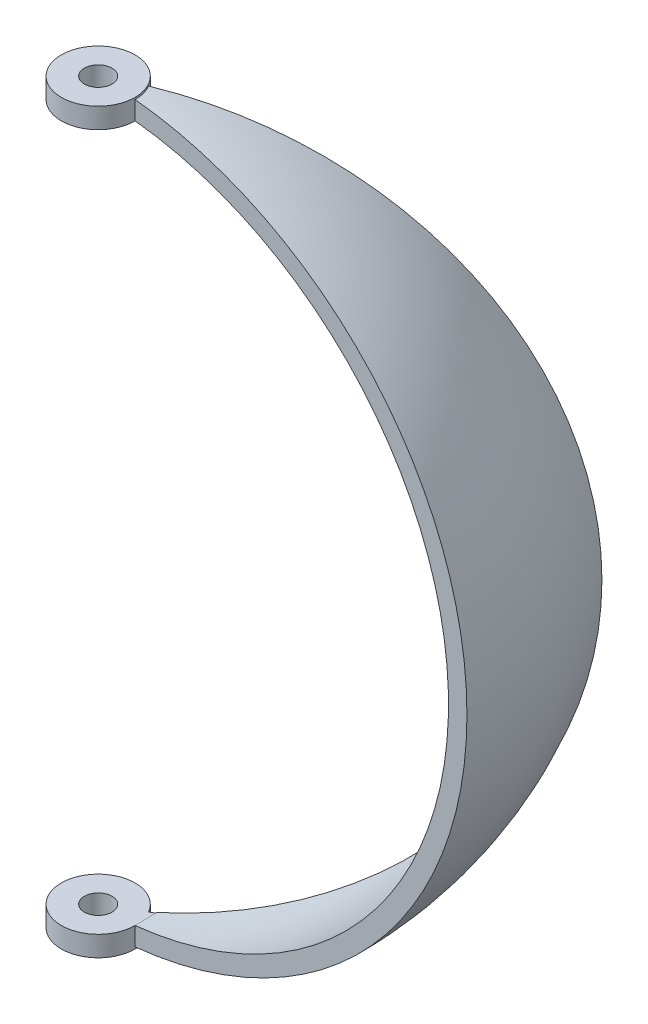
ISO-10303-21;
HEADER;
FILE_DESCRIPTION(('STEP AP214'),'2;1');
FILE_NAME('part.step','',(''),(''),'','','');
FILE_SCHEMA(('AUTOMOTIVE_DESIGN { 1 0 10303 214 1 1 1 1 }'));
ENDSEC;
DATA;
#1=APPLICATION_CONTEXT('core data for automotive mechanical design processes');
#2=APPLICATION_PROTOCOL_DEFINITION('international standard','automotive_design',2000,#1);
#3=PRODUCT_CONTEXT('',#1,'mechanical');
#4=PRODUCT('Part','Part','',(#3));
#5=PRODUCT_RELATED_PRODUCT_CATEGORY('part','',(#4));
#6=PRODUCT_DEFINITION_FORMATION('','',#4);
#7=PRODUCT_DEFINITION_CONTEXT('part definition',#1,'design');
#8=PRODUCT_DEFINITION('design','',#6,#7);
#9=PRODUCT_DEFINITION_SHAPE('','',#8);
#10=(LENGTH_UNIT() NAMED_UNIT(*) SI_UNIT(.MILLI.,.METRE.));
#11=(NAMED_UNIT(*) PLANE_ANGLE_UNIT() SI_UNIT($,.RADIAN.));
#12=(NAMED_UNIT(*) SI_UNIT($,.STERADIAN.) SOLID_ANGLE_UNIT());
#13=UNCERTAINTY_MEASURE_WITH_UNIT(LENGTH_MEASURE(1.E-05),#10,'distance_accuracy_value','');
#14=(GEOMETRIC_REPRESENTATION_CONTEXT(3) GLOBAL_UNCERTAINTY_ASSIGNED_CONTEXT((#13)) GLOBAL_UNIT_ASSIGNED_CONTEXT((#10,
#11,#12)) REPRESENTATION_CONTEXT('',''));
#15=CARTESIAN_POINT('',(0.,0.,0.));
#16=DIRECTION('',(0.,0.,1.));
#17=DIRECTION('',(1.,0.,0.));
#18=AXIS2_PLACEMENT_3D('',#15,#16,#17);
#19=CARTESIAN_POINT('',(0.,50.8,0.));
#20=DIRECTION('',(0.,-1.,0.));
#21=DIRECTION('',(0.,0.,-1.));
#22=AXIS2_PLACEMENT_3D('',#19,#20,#21);
#23=CYLINDRICAL_SURFACE('',#22,5.08);
#24=CARTESIAN_POINT('',(0.,50.8,0.));
#25=DIRECTION('',(0.,1.,0.));
#26=DIRECTION('',(0.,0.,1.));
#27=AXIS2_PLACEMENT_3D('',#24,#25,#26);
#28=CIRCLE('',#27,5.08);
#29=CARTESIAN_POINT('',(0.,50.8,5.08));
#30=VERTEX_POINT('',#29);
#31=EDGE_CURVE('E146',#30,#30,#28,.T.);
#32=ORIENTED_EDGE('',*,*,#31,.F.);
#33=EDGE_LOOP('',(#32));
#34=FACE_BOUND('',#33,.T.);
#35=DIRECTION('',(0.,-1.,0.));
#36=VECTOR('',#35,1.);
#37=CARTESIAN_POINT('',(4.39940905122495,50.8,-2.54000000000001));
#38=LINE('',#37,#36);
#39=CARTESIAN_POINT('',(4.39940905122494,50.5453618050163,-2.54));
#40=VERTEX_POINT('',#39);
#41=CARTESIAN_POINT('',(4.39940905122492,47.9918868143356,-2.53999999999999));
#42=VERTEX_POINT('',#41);
#43=EDGE_CURVE('E124',#40,#42,#38,.T.);
#44=ORIENTED_EDGE('',*,*,#43,.T.);
#45=CARTESIAN_POINT('',(0.,47.9918868143356,0.));
#46=DIRECTION('',(0.,-1.,0.));
#47=DIRECTION('',(0.,0.,-1.));
#48=AXIS2_PLACEMENT_3D('',#45,#46,#47);
#49=CIRCLE('',#48,5.08);
#50=CARTESIAN_POINT('',(5.08,47.9918868143356,0.));
#51=VERTEX_POINT('',#50);
#52=EDGE_CURVE('E90',#51,#42,#49,.T.);
#53=ORIENTED_EDGE('',*,*,#52,.F.);
#54=DIRECTION('',(0.,-1.,0.));
#55=VECTOR('',#54,1.);
#56=CARTESIAN_POINT('',(5.08,50.8,0.));
#57=LINE('',#56,#55);
#58=CARTESIAN_POINT('',(5.08,50.5453618050163,0.));
#59=VERTEX_POINT('',#58);
#60=EDGE_CURVE('E118',#59,#51,#57,.T.);
#61=ORIENTED_EDGE('',*,*,#60,.F.);
#62=CARTESIAN_POINT('',(0.,50.5453618050163,0.));
#63=DIRECTION('',(0.,-1.,0.));
#64=DIRECTION('',(0.,0.,-1.));
#65=AXIS2_PLACEMENT_3D('',#62,#63,#64);
#66=CIRCLE('',#65,5.08);
#67=EDGE_CURVE('E128',#40,#59,#66,.T.);
#68=ORIENTED_EDGE('',*,*,#67,.F.);
#69=EDGE_LOOP('',(#44,#53,#61,#68));
#70=FACE_BOUND('',#69,.T.);
#71=ADVANCED_FACE('F34',(#34,#70),#23,.T.);
#72=CARTESIAN_POINT('',(0.,-50.8,0.));
#73=DIRECTION('',(0.,1.,0.));
#74=DIRECTION('',(0.,0.,1.));
#75=AXIS2_PLACEMENT_3D('',#72,#73,#74);
#76=CIRCLE('',#75,5.08);
#77=CARTESIAN_POINT('',(0.,-50.8,5.08));
#78=VERTEX_POINT('',#77);
#79=EDGE_CURVE('E151',#78,#78,#76,.T.);
#80=ORIENTED_EDGE('',*,*,#79,.T.);
#81=EDGE_LOOP('',(#80));
#82=FACE_BOUND('',#81,.T.);
#83=CARTESIAN_POINT('',(0.,-47.9918868143356,0.));
#84=DIRECTION('',(0.,1.,0.));
#85=DIRECTION('',(0.,0.,1.));
#86=AXIS2_PLACEMENT_3D('',#83,#84,#85);
#87=CIRCLE('',#86,5.08);
#88=CARTESIAN_POINT('',(4.39940905122495,-47.9918868143356,-2.54000000000001));
#89=VERTEX_POINT('',#88);
#90=CARTESIAN_POINT('',(5.08,-47.9918868143356,0.));
#91=VERTEX_POINT('',#90);
#92=EDGE_CURVE('E86',#89,#91,#87,.T.);
#93=ORIENTED_EDGE('',*,*,#92,.F.);
#94=CARTESIAN_POINT('',(4.39940905122494,-50.5453618050163,-2.54));
#95=VERTEX_POINT('',#94);
#96=EDGE_CURVE('E130',#89,#95,#38,.T.);
#97=ORIENTED_EDGE('',*,*,#96,.T.);
#98=CARTESIAN_POINT('',(0.,-50.5453618050163,0.));
#99=DIRECTION('',(0.,1.,0.));
#100=DIRECTION('',(0.,0.,1.));
#101=AXIS2_PLACEMENT_3D('',#98,#99,#100);
#102=CIRCLE('',#101,5.08);
#103=CARTESIAN_POINT('',(5.08,-50.5453618050163,0.));
#104=VERTEX_POINT('',#103);
#105=EDGE_CURVE('E58',#104,#95,#102,.T.);
#106=ORIENTED_EDGE('',*,*,#105,.F.);
#107=EDGE_CURVE('E113',#91,#104,#57,.T.);
#108=ORIENTED_EDGE('',*,*,#107,.F.);
#109=EDGE_LOOP('',(#93,#97,#106,#108));
#110=FACE_BOUND('',#109,.T.);
#111=ADVANCED_FACE('F114',(#82,#110),#23,.T.);
#112=CARTESIAN_POINT('',(0.,0.,0.));
#113=DIRECTION('',(0.,-1.,0.));
#114=DIRECTION('',(-0.866025403784438,0.,0.500000000000001));
#115=AXIS2_PLACEMENT_3D('',#112,#113,#114);
#116=SPHERICAL_SURFACE('',#115,48.26);
#117=CARTESIAN_POINT('',(5.08,0.,0.));
#118=DIRECTION('',(-1.,0.,0.));
#119=DIRECTION('',(0.,0.,1.));
#120=AXIS2_PLACEMENT_3D('',#117,#118,#119);
#121=CIRCLE('',#120,47.9918868143356);
#122=CARTESIAN_POINT('',(5.08,-47.9021822745756,-2.93293936748331));
#123=VERTEX_POINT('',#122);
#124=EDGE_CURVE('E96',#91,#123,#121,.F.);
#125=ORIENTED_EDGE('',*,*,#124,.F.);
#126=CARTESIAN_POINT('',(0.,0.,0.));
#127=DIRECTION('',(0.,0.,1.));
#128=DIRECTION('',(1.,0.,0.));
#129=AXIS2_PLACEMENT_3D('',#126,#127,#128);
#130=CIRCLE('',#129,48.26);
#131=EDGE_CURVE('E108',#91,#51,#130,.T.);
#132=ORIENTED_EDGE('',*,*,#131,.T.);
#133=CARTESIAN_POINT('',(5.08,47.9021822745756,-2.93293936748331));
#134=VERTEX_POINT('',#133);
#135=EDGE_CURVE('E111',#134,#51,#121,.F.);
#136=ORIENTED_EDGE('',*,*,#135,.F.);
#137=CARTESIAN_POINT('',(0.,0.,0.));
#138=DIRECTION('',(0.500000000000001,0.,0.866025403784438));
#139=DIRECTION('',(0.866025403784438,0.,-0.500000000000001));
#140=AXIS2_PLACEMENT_3D('',#137,#138,#139);
#141=CIRCLE('',#140,48.26);
#142=EDGE_CURVE('E110',#123,#134,#141,.T.);
#143=ORIENTED_EDGE('',*,*,#142,.F.);
#144=EDGE_LOOP('',(#125,#132,#136,#143));
#145=FACE_BOUND('',#144,.T.);
#146=ADVANCED_FACE('F105',(#145),#116,.F.);
#147=CARTESIAN_POINT('',(0.,0.,0.));
#148=DIRECTION('',(0.500000000000001,0.,0.866025403784438));
#149=DIRECTION('',(0.866025403784438,0.,-0.500000000000001));
#150=AXIS2_PLACEMENT_3D('',#147,#148,#149);
#151=PLANE('',#150);
#152=DIRECTION('',(0.,-1.,0.));
#153=VECTOR('',#152,1.);
#154=CARTESIAN_POINT('',(5.08,0.,-2.93293936748331));
#155=LINE('',#154,#153);
#156=CARTESIAN_POINT('',(5.08,47.9918868143356,-2.9329393674833));
#157=VERTEX_POINT('',#156);
#158=EDGE_CURVE('E91',#157,#134,#155,.T.);
#159=ORIENTED_EDGE('',*,*,#158,.F.);
#160=DIRECTION('',(0.866025403784438,0.,-0.500000000000001));
#161=VECTOR('',#160,1.);
#162=CARTESIAN_POINT('',(0.,47.9918868143356,0.));
#163=LINE('',#162,#161);
#164=EDGE_CURVE('E11',#42,#157,#163,.T.);
#165=ORIENTED_EDGE('',*,*,#164,.F.);
#166=ORIENTED_EDGE('',*,*,#43,.F.);
#167=CARTESIAN_POINT('',(0.,0.,0.));
#168=DIRECTION('',(0.500000000000001,0.,0.866025403784438));
#169=DIRECTION('',(0.866025403784438,0.,-0.500000000000001));
#170=AXIS2_PLACEMENT_3D('',#167,#168,#169);
#171=CIRCLE('',#170,50.8);
#172=EDGE_CURVE('E119',#95,#40,#171,.T.);
#173=ORIENTED_EDGE('',*,*,#172,.F.);
#174=ORIENTED_EDGE('',*,*,#96,.F.);
#175=DIRECTION('',(-0.866025403784438,0.,0.500000000000001));
#176=VECTOR('',#175,1.);
#177=CARTESIAN_POINT('',(0.,-47.9918868143356,0.));
#178=LINE('',#177,#176);
#179=CARTESIAN_POINT('',(5.08,-47.9918868143356,-2.93293936748331));
#180=VERTEX_POINT('',#179);
#181=EDGE_CURVE('E43',#180,#89,#178,.T.);
#182=ORIENTED_EDGE('',*,*,#181,.F.);
#183=EDGE_CURVE('E98',#123,#180,#155,.T.);
#184=ORIENTED_EDGE('',*,*,#183,.F.);
#185=ORIENTED_EDGE('',*,*,#142,.T.);
#186=EDGE_LOOP('',(#159,#165,#166,#173,#174,#182,#184,#185));
#187=FACE_BOUND('',#186,.T.);
#188=ADVANCED_FACE('F142',(#187),#151,.F.);
#189=CARTESIAN_POINT('',(0.,50.8,0.));
#190=DIRECTION('',(0.,1.,0.));
#191=DIRECTION('',(0.,0.,1.));
#192=AXIS2_PLACEMENT_3D('',#189,#190,#191);
#193=PLANE('',#192);
#194=CARTESIAN_POINT('',(0.,50.8,0.));
#195=DIRECTION('',(0.,1.,0.));
#196=DIRECTION('',(0.,0.,1.));
#197=AXIS2_PLACEMENT_3D('',#194,#195,#196);
#198=CIRCLE('',#197,1.905);
#199=CARTESIAN_POINT('',(0.,50.8,1.905));
#200=VERTEX_POINT('',#199);
#201=EDGE_CURVE('E100',#200,#200,#198,.T.);
#202=ORIENTED_EDGE('',*,*,#201,.F.);
#203=EDGE_LOOP('',(#202));
#204=FACE_BOUND('',#203,.T.);
#205=ORIENTED_EDGE('',*,*,#31,.T.);
#206=EDGE_LOOP('',(#205));
#207=FACE_BOUND('',#206,.T.);
#208=ADVANCED_FACE('F199',(#204,#207),#193,.T.);
#209=CARTESIAN_POINT('',(0.,-50.8,0.));
#210=DIRECTION('',(0.,1.,0.));
#211=DIRECTION('',(0.,0.,1.));
#212=AXIS2_PLACEMENT_3D('',#209,#210,#211);
#213=PLANE('',#212);
#214=CARTESIAN_POINT('',(0.,-50.8,0.));
#215=DIRECTION('',(0.,1.,0.));
#216=DIRECTION('',(0.,0.,1.));
#217=AXIS2_PLACEMENT_3D('',#214,#215,#216);
#218=CIRCLE('',#217,1.905);
#219=CARTESIAN_POINT('',(0.,-50.8,1.905));
#220=VERTEX_POINT('',#219);
#221=EDGE_CURVE('E163',#220,#220,#218,.T.);
#222=ORIENTED_EDGE('',*,*,#221,.T.);
#223=EDGE_LOOP('',(#222));
#224=FACE_BOUND('',#223,.T.);
#225=ORIENTED_EDGE('',*,*,#79,.F.);
#226=EDGE_LOOP('',(#225));
#227=FACE_BOUND('',#226,.T.);
#228=ADVANCED_FACE('F219',(#224,#227),#213,.F.);
#229=CARTESIAN_POINT('',(0.,0.,0.));
#230=DIRECTION('',(0.,-1.,0.));
#231=DIRECTION('',(-0.866025403784438,0.,0.500000000000001));
#232=AXIS2_PLACEMENT_3D('',#229,#230,#231);
#233=SPHERICAL_SURFACE('',#232,50.8);
#234=CARTESIAN_POINT('',(0.,0.,0.));
#235=DIRECTION('',(0.,0.,1.));
#236=DIRECTION('',(1.,0.,0.));
#237=AXIS2_PLACEMENT_3D('',#234,#235,#236);
#238=CIRCLE('',#237,50.8);
#239=EDGE_CURVE('E123',#104,#59,#238,.T.);
#240=ORIENTED_EDGE('',*,*,#239,.F.);
#241=ORIENTED_EDGE('',*,*,#105,.T.);
#242=ORIENTED_EDGE('',*,*,#172,.T.);
#243=ORIENTED_EDGE('',*,*,#67,.T.);
#244=EDGE_LOOP('',(#240,#241,#242,#243));
#245=FACE_BOUND('',#244,.T.);
#246=ADVANCED_FACE('F36',(#245),#233,.T.);
#247=CARTESIAN_POINT('',(0.,0.,0.));
#248=DIRECTION('',(0.,0.,1.));
#249=DIRECTION('',(1.,0.,0.));
#250=AXIS2_PLACEMENT_3D('',#247,#248,#249);
#251=PLANE('',#250);
#252=ORIENTED_EDGE('',*,*,#239,.T.);
#253=ORIENTED_EDGE('',*,*,#60,.T.);
#254=ORIENTED_EDGE('',*,*,#131,.F.);
#255=ORIENTED_EDGE('',*,*,#107,.T.);
#256=EDGE_LOOP('',(#252,#253,#254,#255));
#257=FACE_BOUND('',#256,.T.);
#258=ADVANCED_FACE('F122',(#257),#251,.T.);
#259=CARTESIAN_POINT('',(5.08,47.9918868143356,40.386));
#260=DIRECTION('',(-1.,0.,0.));
#261=DIRECTION('',(0.,0.,1.));
#262=AXIS2_PLACEMENT_3D('',#259,#260,#261);
#263=PLANE('',#262);
#264=ORIENTED_EDGE('',*,*,#124,.T.);
#265=ORIENTED_EDGE('',*,*,#183,.T.);
#266=DIRECTION('',(0.,0.,-1.));
#267=VECTOR('',#266,1.);
#268=CARTESIAN_POINT('',(5.08,-47.9918868143356,40.386));
#269=LINE('',#268,#267);
#270=EDGE_CURVE('E50',#91,#180,#269,.T.);
#271=ORIENTED_EDGE('',*,*,#270,.F.);
#272=EDGE_LOOP('',(#264,#265,#271));
#273=FACE_BOUND('',#272,.T.);
#274=ADVANCED_FACE('F95',(#273),#263,.T.);
#275=CARTESIAN_POINT('',(5.08,-47.9918868143356,40.386));
#276=DIRECTION('',(0.,1.,0.));
#277=DIRECTION('',(0.,0.,1.));
#278=AXIS2_PLACEMENT_3D('',#275,#276,#277);
#279=PLANE('',#278);
#280=CARTESIAN_POINT('',(0.,-47.9918868143356,0.));
#281=DIRECTION('',(0.,1.,0.));
#282=DIRECTION('',(0.,0.,1.));
#283=AXIS2_PLACEMENT_3D('',#280,#281,#282);
#284=CIRCLE('',#283,1.905);
#285=CARTESIAN_POINT('',(0.,-47.9918868143356,1.905));
#286=VERTEX_POINT('',#285);
#287=EDGE_CURVE('E160',#286,#286,#284,.T.);
#288=ORIENTED_EDGE('',*,*,#287,.F.);
#289=EDGE_LOOP('',(#288));
#290=FACE_BOUND('',#289,.T.);
#291=ORIENTED_EDGE('',*,*,#92,.T.);
#292=ORIENTED_EDGE('',*,*,#270,.T.);
#293=ORIENTED_EDGE('',*,*,#181,.T.);
#294=EDGE_LOOP('',(#291,#292,#293));
#295=FACE_BOUND('',#294,.T.);
#296=ADVANCED_FACE('F87',(#290,#295),#279,.T.);
#297=CARTESIAN_POINT('',(5.08,47.9918868143356,40.386));
#298=DIRECTION('',(0.,-1.,0.));
#299=DIRECTION('',(0.,0.,-1.));
#300=AXIS2_PLACEMENT_3D('',#297,#298,#299);
#301=PLANE('',#300);
#302=CARTESIAN_POINT('',(0.,47.9918868143356,0.));
#303=DIRECTION('',(0.,-1.,0.));
#304=DIRECTION('',(0.,0.,-1.));
#305=AXIS2_PLACEMENT_3D('',#302,#303,#304);
#306=CIRCLE('',#305,1.905);
#307=CARTESIAN_POINT('',(0.,47.9918868143356,-1.905));
#308=VERTEX_POINT('',#307);
#309=EDGE_CURVE('E38',#308,#308,#306,.T.);
#310=ORIENTED_EDGE('',*,*,#309,.F.);
#311=EDGE_LOOP('',(#310));
#312=FACE_BOUND('',#311,.T.);
#313=ORIENTED_EDGE('',*,*,#52,.T.);
#314=ORIENTED_EDGE('',*,*,#164,.T.);
#315=DIRECTION('',(0.,0.,-1.));
#316=VECTOR('',#315,1.);
#317=CARTESIAN_POINT('',(5.08,47.9918868143356,40.386));
#318=LINE('',#317,#316);
#319=EDGE_CURVE('E99',#51,#157,#318,.T.);
#320=ORIENTED_EDGE('',*,*,#319,.F.);
#321=EDGE_LOOP('',(#313,#314,#320));
#322=FACE_BOUND('',#321,.T.);
#323=ADVANCED_FACE('F172',(#312,#322),#301,.T.);
#324=ORIENTED_EDGE('',*,*,#158,.T.);
#325=ORIENTED_EDGE('',*,*,#135,.T.);
#326=ORIENTED_EDGE('',*,*,#319,.T.);
#327=EDGE_LOOP('',(#324,#325,#326));
#328=FACE_BOUND('',#327,.T.);
#329=ADVANCED_FACE('F175',(#328),#263,.T.);
#330=CARTESIAN_POINT('',(0.,-50.8,0.));
#331=DIRECTION('',(0.,1.,0.));
#332=DIRECTION('',(0.,0.,1.));
#333=AXIS2_PLACEMENT_3D('',#330,#331,#332);
#334=CYLINDRICAL_SURFACE('',#333,1.905);
#335=ORIENTED_EDGE('',*,*,#201,.T.);
#336=EDGE_LOOP('',(#335));
#337=FACE_BOUND('',#336,.T.);
#338=ORIENTED_EDGE('',*,*,#309,.T.);
#339=EDGE_LOOP('',(#338));
#340=FACE_BOUND('',#339,.T.);
#341=ADVANCED_FACE('F170',(#337,#340),#334,.F.);
#342=ORIENTED_EDGE('',*,*,#287,.T.);
#343=EDGE_LOOP('',(#342));
#344=FACE_BOUND('',#343,.T.);
#345=ORIENTED_EDGE('',*,*,#221,.F.);
#346=EDGE_LOOP('',(#345));
#347=FACE_BOUND('',#346,.T.);
#348=ADVANCED_FACE('F184',(#344,#347),#334,.F.);
#349=CLOSED_SHELL('',(#71,#111,#146,#188,#208,#228,#246,#258,#274,#296,#323,#329,#341,#348));
#350=MANIFOLD_SOLID_BREP('B2',#349);
#351=ADVANCED_BREP_SHAPE_REPRESENTATION('',(#18,#350),#14);
#352=SHAPE_DEFINITION_REPRESENTATION(#9,#351);
ENDSEC;
END-ISO-10303-21;
